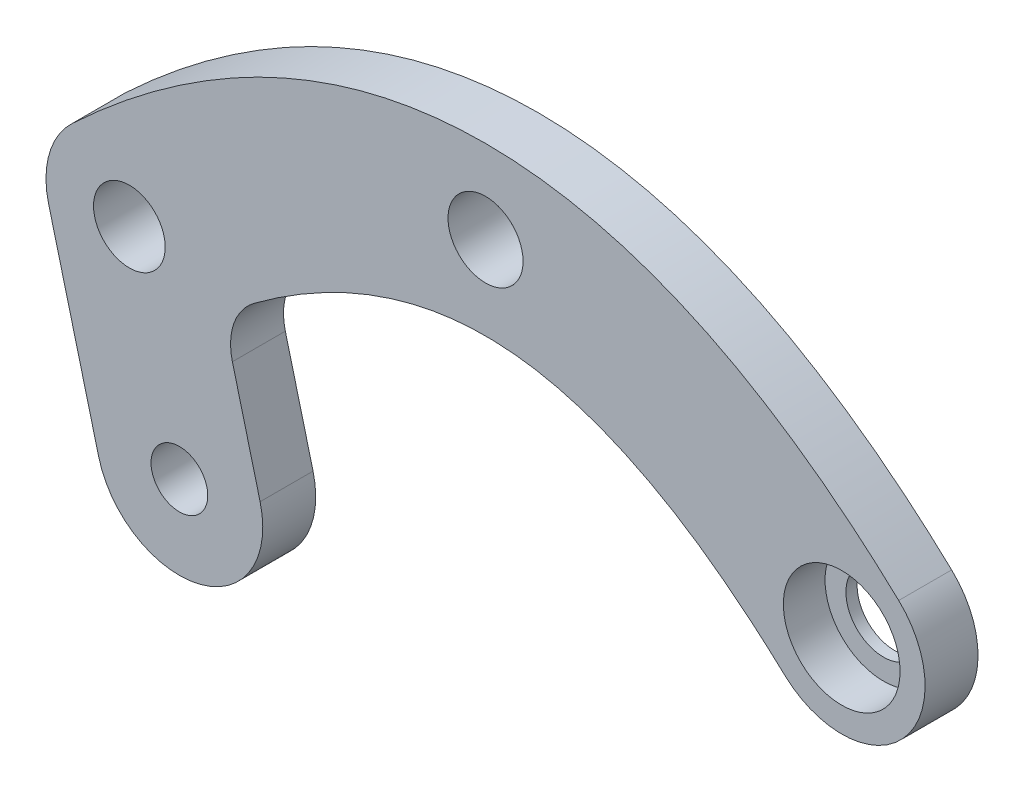
ISO-10303-21;
HEADER;
FILE_DESCRIPTION(('STEP AP214'),'2;1');
FILE_NAME('part.step','',(''),(''),'','','');
FILE_SCHEMA(('AUTOMOTIVE_DESIGN { 1 0 10303 214 1 1 1 1 }'));
ENDSEC;
DATA;
#1=APPLICATION_CONTEXT('core data for automotive mechanical design processes');
#2=APPLICATION_PROTOCOL_DEFINITION('international standard','automotive_design',2000,#1);
#3=PRODUCT_CONTEXT('',#1,'mechanical');
#4=PRODUCT('Part','Part','',(#3));
#5=PRODUCT_RELATED_PRODUCT_CATEGORY('part','',(#4));
#6=PRODUCT_DEFINITION_FORMATION('','',#4);
#7=PRODUCT_DEFINITION_CONTEXT('part definition',#1,'design');
#8=PRODUCT_DEFINITION('design','',#6,#7);
#9=PRODUCT_DEFINITION_SHAPE('','',#8);
#10=(LENGTH_UNIT() NAMED_UNIT(*) SI_UNIT(.MILLI.,.METRE.));
#11=(NAMED_UNIT(*) PLANE_ANGLE_UNIT() SI_UNIT($,.RADIAN.));
#12=(NAMED_UNIT(*) SI_UNIT($,.STERADIAN.) SOLID_ANGLE_UNIT());
#13=UNCERTAINTY_MEASURE_WITH_UNIT(LENGTH_MEASURE(1.E-05),#10,'distance_accuracy_value','');
#14=(GEOMETRIC_REPRESENTATION_CONTEXT(3) GLOBAL_UNCERTAINTY_ASSIGNED_CONTEXT((#13)) GLOBAL_UNIT_ASSIGNED_CONTEXT((#10,
#11,#12)) REPRESENTATION_CONTEXT('',''));
#15=CARTESIAN_POINT('',(0.,0.,0.));
#16=DIRECTION('',(0.,0.,1.));
#17=DIRECTION('',(1.,0.,0.));
#18=AXIS2_PLACEMENT_3D('',#15,#16,#17);
#19=CARTESIAN_POINT('',(21.36,-10.,1.5875));
#20=DIRECTION('',(0.,0.,1.));
#21=DIRECTION('',(1.,0.,0.));
#22=AXIS2_PLACEMENT_3D('',#19,#20,#21);
#23=CYLINDRICAL_SURFACE('',#22,2.24999999999999);
#24=CARTESIAN_POINT('',(21.36,-10.,-1.5875));
#25=DIRECTION('',(0.,0.,1.));
#26=DIRECTION('',(1.,0.,0.));
#27=AXIS2_PLACEMENT_3D('',#24,#25,#26);
#28=CIRCLE('',#27,2.25);
#29=CARTESIAN_POINT('',(23.61,-10.,-1.5875));
#30=VERTEX_POINT('',#29);
#31=EDGE_CURVE('E239',#30,#30,#28,.T.);
#32=ORIENTED_EDGE('',*,*,#31,.F.);
#33=EDGE_LOOP('',(#32));
#34=FACE_BOUND('',#33,.T.);
#35=CARTESIAN_POINT('',(21.36,-10.,-0.9125));
#36=DIRECTION('',(0.,0.,1.));
#37=DIRECTION('',(1.,0.,0.));
#38=AXIS2_PLACEMENT_3D('',#35,#36,#37);
#39=CIRCLE('',#38,2.24999999999999);
#40=CARTESIAN_POINT('',(23.61,-10.,-0.9125));
#41=VERTEX_POINT('',#40);
#42=EDGE_CURVE('E53',#41,#41,#39,.F.);
#43=ORIENTED_EDGE('',*,*,#42,.F.);
#44=EDGE_LOOP('',(#43));
#45=FACE_BOUND('',#44,.T.);
#46=ADVANCED_FACE('F49',(#34,#45),#23,.F.);
#47=CARTESIAN_POINT('',(0.,0.,-1.5875));
#48=DIRECTION('',(0.,0.,1.));
#49=DIRECTION('',(1.,0.,0.));
#50=AXIS2_PLACEMENT_3D('',#47,#48,#49);
#51=PLANE('',#50);
#52=CARTESIAN_POINT('',(0.,0.,-1.5875));
#53=DIRECTION('',(0.,0.,1.));
#54=DIRECTION('',(1.,0.,0.));
#55=AXIS2_PLACEMENT_3D('',#52,#53,#54);
#56=CIRCLE('',#55,2.25);
#57=CARTESIAN_POINT('',(2.25,0.,-1.5875));
#58=VERTEX_POINT('',#57);
#59=EDGE_CURVE('E252',#58,#58,#56,.T.);
#60=ORIENTED_EDGE('',*,*,#59,.T.);
#61=EDGE_LOOP('',(#60));
#62=FACE_BOUND('',#61,.T.);
#63=ORIENTED_EDGE('',*,*,#31,.T.);
#64=EDGE_LOOP('',(#63));
#65=FACE_BOUND('',#64,.T.);
#66=CARTESIAN_POINT('',(-17.9425685709007,-13.649816766278,-1.5875));
#67=CARTESIAN_POINT('',(-14.2685695152053,-10.2286843129854,-1.5875));
#68=CARTESIAN_POINT('',(-8.53005202111008,-6.88377787776774,-1.5875));
#69=CARTESIAN_POINT('',(-4.17884967888289,-5.36413027981006,-1.5875));
#70=CARTESIAN_POINT('',(0.,-4.87862324006331,-1.5875));
#71=CARTESIAN_POINT('',(4.17884967888289,-5.36413027981006,-1.5875));
#72=CARTESIAN_POINT('',(8.53005202111008,-6.88377787776774,-1.5875));
#73=CARTESIAN_POINT('',(14.2685695152053,-10.2286843129854,-1.5875));
#74=CARTESIAN_POINT('',(17.9425685709007,-13.649816766278,-1.5875));
#75=B_SPLINE_CURVE_WITH_KNOTS('',2,(#66,#67,#68,#69,#70,#71,#72,#73,#74),.UNSPECIFIED.,.F.,.F.,
(3,1,1,1,1,1,1,3),(0.,0.1875,0.3125,0.4375,0.5625,0.6875,0.8125,1.),.UNSPECIFIED.);
#76=CARTESIAN_POINT('',(-13.8750452365153,-10.2430725469191,-1.5875));
#77=VERTEX_POINT('',#76);
#78=CARTESIAN_POINT('',(17.9425685709007,-13.649816766278,-1.5875));
#79=VERTEX_POINT('',#78);
#80=EDGE_CURVE('E261',#77,#79,#75,.T.);
#81=ORIENTED_EDGE('',*,*,#80,.F.);
#82=CARTESIAN_POINT('',(-11.7922158615803,-13.0558686282069,-1.5875));
#83=DIRECTION('',(0.,0.,1.));
#84=DIRECTION('',(1.,0.,0.));
#85=AXIS2_PLACEMENT_3D('',#82,#83,#84);
#86=CIRCLE('',#85,3.5);
#87=CARTESIAN_POINT('',(-15.1810762895118,-13.9308686282069,-1.5875));
#88=VERTEX_POINT('',#87);
#89=EDGE_CURVE('E66',#77,#88,#86,.T.);
#90=ORIENTED_EDGE('',*,*,#89,.T.);
#91=DIRECTION('',(-0.25,0.968245836551854,0.));
#92=VECTOR('',#91,1.);
#93=CARTESIAN_POINT('',(-17.6043854086204,-4.5454327671869,-1.5875));
#94=LINE('',#93,#92);
#95=CARTESIAN_POINT('',(-13.5187708172407,-20.3689500386223,-1.5875));
#96=VERTEX_POINT('',#95);
#97=EDGE_CURVE('E228',#96,#88,#94,.T.);
#98=ORIENTED_EDGE('',*,*,#97,.F.);
#99=CARTESIAN_POINT('',(-18.36,-21.6189500386222,-1.5875));
#100=DIRECTION('',(0.,0.,-1.));
#101=DIRECTION('',(-1.,0.,0.));
#102=AXIS2_PLACEMENT_3D('',#99,#100,#101);
#103=CIRCLE('',#102,5.);
#104=CARTESIAN_POINT('',(-23.2012291827593,-22.8689500386223,-1.5875));
#105=VERTEX_POINT('',#104);
#106=EDGE_CURVE('E229',#105,#96,#103,.F.);
#107=ORIENTED_EDGE('',*,*,#106,.F.);
#108=DIRECTION('',(-0.25,0.968245836551854,0.));
#109=VECTOR('',#108,1.);
#110=CARTESIAN_POINT('',(-27.2868437741389,-7.0454327671869,-1.5875));
#111=LINE('',#110,#109);
#112=CARTESIAN_POINT('',(-26.2012291827593,-11.25,-1.5875));
#113=VERTEX_POINT('',#112);
#114=EDGE_CURVE('E224',#105,#113,#111,.T.);
#115=ORIENTED_EDGE('',*,*,#114,.T.);
#116=CARTESIAN_POINT('',(-21.36,-10.,-1.5875));
#117=DIRECTION('',(0.,0.,1.));
#118=DIRECTION('',(1.,0.,0.));
#119=AXIS2_PLACEMENT_3D('',#116,#117,#118);
#120=CIRCLE('',#119,5.);
#121=CARTESIAN_POINT('',(-24.7774314290993,-6.35018323372195,-1.5875));
#122=VERTEX_POINT('',#121);
#123=EDGE_CURVE('E136',#113,#122,#120,.F.);
#124=ORIENTED_EDGE('',*,*,#123,.T.);
#125=CARTESIAN_POINT('',(-24.7774314290993,-6.35018323372195,-1.5875));
#126=CARTESIAN_POINT('',(-20.4414304847947,-2.27131568701465,-1.5875));
#127=CARTESIAN_POINT('',(-12.8299479788899,2.19627787776774,-1.5875));
#128=CARTESIAN_POINT('',(-6.50115032111711,4.42663027981006,-1.5875));
#129=CARTESIAN_POINT('',(0.,5.19112324006331,-1.5875));
#130=CARTESIAN_POINT('',(6.50115032111711,4.42663027981006,-1.5875));
#131=CARTESIAN_POINT('',(12.8299479788899,2.19627787776774,-1.5875));
#132=CARTESIAN_POINT('',(20.4414304847947,-2.27131568701464,-1.5875));
#133=CARTESIAN_POINT('',(24.7774314290993,-6.35018323372195,-1.5875));
#134=B_SPLINE_CURVE_WITH_KNOTS('',2,(#125,#126,#127,#128,#129,#130,#131,#132,#133),
.UNSPECIFIED.,.F.,.F.,(3,1,1,1,1,1,1,3),(0.,0.1875,0.3125,0.4375,0.5625,0.6875,0.8125,1.),.UNSPECIFIED.);
#135=CARTESIAN_POINT('',(24.7774314290993,-6.35018323372195,-1.5875));
#136=VERTEX_POINT('',#135);
#137=EDGE_CURVE('E255',#122,#136,#134,.T.);
#138=ORIENTED_EDGE('',*,*,#137,.T.);
#139=CARTESIAN_POINT('',(21.36,-10.,-1.5875));
#140=DIRECTION('',(0.,0.,1.));
#141=DIRECTION('',(1.,0.,0.));
#142=AXIS2_PLACEMENT_3D('',#139,#140,#141);
#143=CIRCLE('',#142,5.);
#144=EDGE_CURVE('E151',#79,#136,#143,.T.);
#145=ORIENTED_EDGE('',*,*,#144,.F.);
#146=EDGE_LOOP('',(#81,#90,#98,#107,#115,#124,#138,#145));
#147=FACE_BOUND('',#146,.T.);
#148=CARTESIAN_POINT('',(-18.36,-21.6189500386222,-1.5875));
#149=DIRECTION('',(0.,0.,-1.));
#150=DIRECTION('',(-1.,0.,0.));
#151=AXIS2_PLACEMENT_3D('',#148,#149,#150);
#152=CIRCLE('',#151,1.69999999999999);
#153=CARTESIAN_POINT('',(-20.06,-21.6189500386222,-1.5875));
#154=VERTEX_POINT('',#153);
#155=EDGE_CURVE('E217',#154,#154,#152,.T.);
#156=ORIENTED_EDGE('',*,*,#155,.F.);
#157=EDGE_LOOP('',(#156));
#158=FACE_BOUND('',#157,.T.);
#159=CARTESIAN_POINT('',(-21.36,-10.,-1.5875));
#160=DIRECTION('',(0.,0.,1.));
#161=DIRECTION('',(1.,0.,0.));
#162=AXIS2_PLACEMENT_3D('',#159,#160,#161);
#163=CIRCLE('',#162,2.75);
#164=CARTESIAN_POINT('',(-18.61,-10.,-1.5875));
#165=VERTEX_POINT('',#164);
#166=EDGE_CURVE('E11',#165,#165,#163,.F.);
#167=ORIENTED_EDGE('',*,*,#166,.F.);
#168=EDGE_LOOP('',(#167));
#169=FACE_BOUND('',#168,.T.);
#170=ADVANCED_FACE('F175',(#62,#65,#147,#158,#169),#51,.F.);
#171=CARTESIAN_POINT('',(-21.36,-10.,1.5875));
#172=DIRECTION('',(0.,0.,-1.));
#173=DIRECTION('',(-1.,0.,0.));
#174=AXIS2_PLACEMENT_3D('',#171,#172,#173);
#175=CYLINDRICAL_SURFACE('',#174,5.);
#176=ORIENTED_EDGE('',*,*,#123,.F.);
#177=DIRECTION('',(0.,0.,-1.));
#178=VECTOR('',#177,1.);
#179=CARTESIAN_POINT('',(-26.2012291827593,-11.25,21.6150258635163));
#180=LINE('',#179,#178);
#181=CARTESIAN_POINT('',(-26.2012291827593,-11.25,1.5875));
#182=VERTEX_POINT('',#181);
#183=EDGE_CURVE('E122',#182,#113,#180,.T.);
#184=ORIENTED_EDGE('',*,*,#183,.F.);
#185=CARTESIAN_POINT('',(-21.36,-10.,1.5875));
#186=DIRECTION('',(0.,0.,1.));
#187=DIRECTION('',(1.,0.,0.));
#188=AXIS2_PLACEMENT_3D('',#185,#186,#187);
#189=CIRCLE('',#188,5.);
#190=CARTESIAN_POINT('',(-24.7774314290993,-6.35018323372195,1.5875));
#191=VERTEX_POINT('',#190);
#192=EDGE_CURVE('E134',#182,#191,#189,.F.);
#193=ORIENTED_EDGE('',*,*,#192,.T.);
#194=DIRECTION('',(0.,0.,-1.));
#195=VECTOR('',#194,1.);
#196=CARTESIAN_POINT('',(-24.7774314290993,-6.35018323372195,1.5875));
#197=LINE('',#196,#195);
#198=EDGE_CURVE('E286',#191,#122,#197,.T.);
#199=ORIENTED_EDGE('',*,*,#198,.T.);
#200=EDGE_LOOP('',(#176,#184,#193,#199));
#201=FACE_BOUND('',#200,.T.);
#202=ADVANCED_FACE('F132',(#201),#175,.T.);
#203=CARTESIAN_POINT('',(-17.9425685709007,-13.649816766278,1.5875));
#204=CARTESIAN_POINT('',(-14.2685695152053,-10.2286843129854,1.5875));
#205=CARTESIAN_POINT('',(-8.53005202111008,-6.88377787776774,1.5875));
#206=CARTESIAN_POINT('',(-4.17884967888289,-5.36413027981006,1.5875));
#207=CARTESIAN_POINT('',(0.,-4.87862324006331,1.5875));
#208=CARTESIAN_POINT('',(4.17884967888289,-5.36413027981006,1.5875));
#209=CARTESIAN_POINT('',(8.53005202111008,-6.88377787776774,1.5875));
#210=CARTESIAN_POINT('',(14.2685695152053,-10.2286843129854,1.5875));
#211=CARTESIAN_POINT('',(17.9425685709007,-13.649816766278,1.5875));
#212=B_SPLINE_CURVE_WITH_KNOTS('',2,(#203,#204,#205,#206,#207,#208,#209,#210,#211),
.UNSPECIFIED.,.F.,.F.,(3,1,1,1,1,1,1,3),(0.,0.1875,0.3125,0.4375,0.5625,0.6875,0.8125,1.),.UNSPECIFIED.);
#213=DIRECTION('',(0.,0.,-1.));
#214=VECTOR('',#213,1.);
#215=SURFACE_OF_LINEAR_EXTRUSION('',#212,#214);
#216=CARTESIAN_POINT('',(-13.8750452365153,-10.2430725469191,1.5875));
#217=VERTEX_POINT('',#216);
#218=CARTESIAN_POINT('',(17.9425685709007,-13.649816766278,1.5875));
#219=VERTEX_POINT('',#218);
#220=EDGE_CURVE('E145',#217,#219,#212,.T.);
#221=ORIENTED_EDGE('',*,*,#220,.F.);
#222=DIRECTION('',(0.,0.,-1.));
#223=VECTOR('',#222,1.);
#224=CARTESIAN_POINT('',(-13.8750452365153,-10.2430725469191,1.5875));
#225=LINE('',#224,#223);
#226=EDGE_CURVE('E289',#217,#77,#225,.T.);
#227=ORIENTED_EDGE('',*,*,#226,.T.);
#228=ORIENTED_EDGE('',*,*,#80,.T.);
#229=DIRECTION('',(0.,0.,-1.));
#230=VECTOR('',#229,1.);
#231=CARTESIAN_POINT('',(17.9425685709007,-13.649816766278,1.5875));
#232=LINE('',#231,#230);
#233=EDGE_CURVE('E282',#219,#79,#232,.T.);
#234=ORIENTED_EDGE('',*,*,#233,.F.);
#235=EDGE_LOOP('',(#221,#227,#228,#234));
#236=FACE_BOUND('',#235,.T.);
#237=ADVANCED_FACE('F166',(#236),#215,.F.);
#238=CARTESIAN_POINT('',(-24.7774314290993,-6.35018323372195,1.5875));
#239=CARTESIAN_POINT('',(-20.4414304847947,-2.27131568701465,1.5875));
#240=CARTESIAN_POINT('',(-12.8299479788899,2.19627787776774,1.5875));
#241=CARTESIAN_POINT('',(-6.50115032111711,4.42663027981006,1.5875));
#242=CARTESIAN_POINT('',(0.,5.19112324006331,1.5875));
#243=CARTESIAN_POINT('',(6.50115032111711,4.42663027981006,1.5875));
#244=CARTESIAN_POINT('',(12.8299479788899,2.19627787776774,1.5875));
#245=CARTESIAN_POINT('',(20.4414304847947,-2.27131568701464,1.5875));
#246=CARTESIAN_POINT('',(24.7774314290993,-6.35018323372195,1.5875));
#247=B_SPLINE_CURVE_WITH_KNOTS('',2,(#238,#239,#240,#241,#242,#243,#244,#245,#246),
.UNSPECIFIED.,.F.,.F.,(3,1,1,1,1,1,1,3),(0.,0.1875,0.3125,0.4375,0.5625,0.6875,0.8125,1.),.UNSPECIFIED.);
#248=DIRECTION('',(0.,0.,-1.));
#249=VECTOR('',#248,1.);
#250=SURFACE_OF_LINEAR_EXTRUSION('',#247,#249);
#251=ORIENTED_EDGE('',*,*,#137,.F.);
#252=ORIENTED_EDGE('',*,*,#198,.F.);
#253=CARTESIAN_POINT('',(24.7774314290993,-6.35018323372195,1.5875));
#254=VERTEX_POINT('',#253);
#255=EDGE_CURVE('E143',#191,#254,#247,.T.);
#256=ORIENTED_EDGE('',*,*,#255,.T.);
#257=DIRECTION('',(0.,0.,-1.));
#258=VECTOR('',#257,1.);
#259=CARTESIAN_POINT('',(24.7774314290993,-6.35018323372195,1.5875));
#260=LINE('',#259,#258);
#261=EDGE_CURVE('E279',#254,#136,#260,.T.);
#262=ORIENTED_EDGE('',*,*,#261,.T.);
#263=EDGE_LOOP('',(#251,#252,#256,#262));
#264=FACE_BOUND('',#263,.T.);
#265=ADVANCED_FACE('F170',(#264),#250,.T.);
#266=CARTESIAN_POINT('',(21.36,-10.,1.5875));
#267=DIRECTION('',(0.,0.,-1.));
#268=DIRECTION('',(-1.,0.,0.));
#269=AXIS2_PLACEMENT_3D('',#266,#267,#268);
#270=CYLINDRICAL_SURFACE('',#269,5.);
#271=ORIENTED_EDGE('',*,*,#144,.T.);
#272=ORIENTED_EDGE('',*,*,#261,.F.);
#273=CARTESIAN_POINT('',(21.36,-10.,1.5875));
#274=DIRECTION('',(0.,0.,1.));
#275=DIRECTION('',(1.,0.,0.));
#276=AXIS2_PLACEMENT_3D('',#273,#274,#275);
#277=CIRCLE('',#276,5.);
#278=EDGE_CURVE('E149',#219,#254,#277,.T.);
#279=ORIENTED_EDGE('',*,*,#278,.F.);
#280=ORIENTED_EDGE('',*,*,#233,.T.);
#281=EDGE_LOOP('',(#271,#272,#279,#280));
#282=FACE_BOUND('',#281,.T.);
#283=ADVANCED_FACE('F172',(#282),#270,.T.);
#284=CARTESIAN_POINT('',(0.,0.,1.5875));
#285=DIRECTION('',(0.,0.,1.));
#286=DIRECTION('',(1.,0.,0.));
#287=AXIS2_PLACEMENT_3D('',#284,#285,#286);
#288=PLANE('',#287);
#289=CARTESIAN_POINT('',(21.36,-10.,1.5875));
#290=DIRECTION('',(0.,0.,1.));
#291=DIRECTION('',(1.,0.,0.));
#292=AXIS2_PLACEMENT_3D('',#289,#290,#291);
#293=CIRCLE('',#292,3.5);
#294=CARTESIAN_POINT('',(24.86,-10.,1.5875));
#295=VERTEX_POINT('',#294);
#296=EDGE_CURVE('E208',#295,#295,#293,.T.);
#297=ORIENTED_EDGE('',*,*,#296,.F.);
#298=EDGE_LOOP('',(#297));
#299=FACE_BOUND('',#298,.T.);
#300=CARTESIAN_POINT('',(-21.36,-10.,1.5875));
#301=DIRECTION('',(0.,0.,-1.));
#302=DIRECTION('',(-1.,0.,0.));
#303=AXIS2_PLACEMENT_3D('',#300,#301,#302);
#304=CIRCLE('',#303,2.15);
#305=CARTESIAN_POINT('',(-23.51,-10.,1.5875));
#306=VERTEX_POINT('',#305);
#307=EDGE_CURVE('E212',#306,#306,#304,.T.);
#308=ORIENTED_EDGE('',*,*,#307,.T.);
#309=EDGE_LOOP('',(#308));
#310=FACE_BOUND('',#309,.T.);
#311=CARTESIAN_POINT('',(-18.36,-21.6189500386222,1.5875));
#312=DIRECTION('',(0.,0.,-1.));
#313=DIRECTION('',(-1.,0.,0.));
#314=AXIS2_PLACEMENT_3D('',#311,#312,#313);
#315=CIRCLE('',#314,1.7);
#316=CARTESIAN_POINT('',(-20.06,-21.6189500386222,1.5875));
#317=VERTEX_POINT('',#316);
#318=EDGE_CURVE('E129',#317,#317,#315,.T.);
#319=ORIENTED_EDGE('',*,*,#318,.T.);
#320=EDGE_LOOP('',(#319));
#321=FACE_BOUND('',#320,.T.);
#322=DIRECTION('',(-0.25,0.968245836551854,0.));
#323=VECTOR('',#322,1.);
#324=CARTESIAN_POINT('',(-17.6043854086204,-4.5454327671869,1.5875));
#325=LINE('',#324,#323);
#326=CARTESIAN_POINT('',(-13.5187708172407,-20.3689500386223,1.5875));
#327=VERTEX_POINT('',#326);
#328=CARTESIAN_POINT('',(-15.1810762895118,-13.9308686282069,1.5875));
#329=VERTEX_POINT('',#328);
#330=EDGE_CURVE('E236',#327,#329,#325,.T.);
#331=ORIENTED_EDGE('',*,*,#330,.T.);
#332=CARTESIAN_POINT('',(-11.7922158615803,-13.0558686282069,1.5875));
#333=DIRECTION('',(0.,0.,1.));
#334=DIRECTION('',(1.,0.,0.));
#335=AXIS2_PLACEMENT_3D('',#332,#333,#334);
#336=CIRCLE('',#335,3.5);
#337=EDGE_CURVE('E59',#329,#217,#336,.F.);
#338=ORIENTED_EDGE('',*,*,#337,.T.);
#339=ORIENTED_EDGE('',*,*,#220,.T.);
#340=ORIENTED_EDGE('',*,*,#278,.T.);
#341=ORIENTED_EDGE('',*,*,#255,.F.);
#342=ORIENTED_EDGE('',*,*,#192,.F.);
#343=DIRECTION('',(-0.25,0.968245836551854,0.));
#344=VECTOR('',#343,1.);
#345=CARTESIAN_POINT('',(-27.2868437741389,-7.0454327671869,1.5875));
#346=LINE('',#345,#344);
#347=CARTESIAN_POINT('',(-23.2012291827593,-22.8689500386223,1.5875));
#348=VERTEX_POINT('',#347);
#349=EDGE_CURVE('E118',#348,#182,#346,.T.);
#350=ORIENTED_EDGE('',*,*,#349,.F.);
#351=CARTESIAN_POINT('',(-18.36,-21.6189500386222,1.5875));
#352=DIRECTION('',(0.,0.,1.));
#353=DIRECTION('',(1.,0.,0.));
#354=AXIS2_PLACEMENT_3D('',#351,#352,#353);
#355=CIRCLE('',#354,5.);
#356=EDGE_CURVE('E227',#348,#327,#355,.T.);
#357=ORIENTED_EDGE('',*,*,#356,.T.);
#358=EDGE_LOOP('',(#331,#338,#339,#340,#341,#342,#350,#357));
#359=FACE_BOUND('',#358,.T.);
#360=CARTESIAN_POINT('',(0.,0.,1.5875));
#361=DIRECTION('',(0.,0.,1.));
#362=DIRECTION('',(1.,0.,0.));
#363=AXIS2_PLACEMENT_3D('',#360,#361,#362);
#364=CIRCLE('',#363,2.24999999999999);
#365=CARTESIAN_POINT('',(2.24999999999999,0.,1.5875));
#366=VERTEX_POINT('',#365);
#367=EDGE_CURVE('E249',#366,#366,#364,.T.);
#368=ORIENTED_EDGE('',*,*,#367,.F.);
#369=EDGE_LOOP('',(#368));
#370=FACE_BOUND('',#369,.T.);
#371=ADVANCED_FACE('F140',(#299,#310,#321,#359,#370),#288,.T.);
#372=CARTESIAN_POINT('',(0.,0.,1.5875));
#373=DIRECTION('',(0.,0.,1.));
#374=DIRECTION('',(1.,0.,0.));
#375=AXIS2_PLACEMENT_3D('',#372,#373,#374);
#376=CYLINDRICAL_SURFACE('',#375,2.24999999999999);
#377=ORIENTED_EDGE('',*,*,#59,.F.);
#378=EDGE_LOOP('',(#377));
#379=FACE_BOUND('',#378,.T.);
#380=ORIENTED_EDGE('',*,*,#367,.T.);
#381=EDGE_LOOP('',(#380));
#382=FACE_BOUND('',#381,.T.);
#383=ADVANCED_FACE('F197',(#379,#382),#376,.F.);
#384=CARTESIAN_POINT('',(-27.2868437741389,-7.0454327671869,21.6150258635163));
#385=DIRECTION('',(-0.968245836551854,-0.25,0.));
#386=DIRECTION('',(0.25,-0.968245836551854,0.));
#387=AXIS2_PLACEMENT_3D('',#384,#385,#386);
#388=PLANE('',#387);
#389=DIRECTION('',(0.,0.,-1.));
#390=VECTOR('',#389,1.);
#391=CARTESIAN_POINT('',(-23.2012291827593,-22.8689500386223,21.6150258635163));
#392=LINE('',#391,#390);
#393=EDGE_CURVE('E124',#348,#105,#392,.T.);
#394=ORIENTED_EDGE('',*,*,#393,.F.);
#395=ORIENTED_EDGE('',*,*,#349,.T.);
#396=ORIENTED_EDGE('',*,*,#183,.T.);
#397=ORIENTED_EDGE('',*,*,#114,.F.);
#398=EDGE_LOOP('',(#394,#395,#396,#397));
#399=FACE_BOUND('',#398,.T.);
#400=ADVANCED_FACE('F120',(#399),#388,.T.);
#401=CARTESIAN_POINT('',(-18.36,-21.6189500386222,21.6150258635163));
#402=DIRECTION('',(0.,0.,-1.));
#403=DIRECTION('',(-1.,0.,0.));
#404=AXIS2_PLACEMENT_3D('',#401,#402,#403);
#405=CYLINDRICAL_SURFACE('',#404,5.);
#406=ORIENTED_EDGE('',*,*,#356,.F.);
#407=ORIENTED_EDGE('',*,*,#393,.T.);
#408=ORIENTED_EDGE('',*,*,#106,.T.);
#409=DIRECTION('',(0.,0.,-1.));
#410=VECTOR('',#409,1.);
#411=CARTESIAN_POINT('',(-13.5187708172407,-20.3689500386223,21.6150258635163));
#412=LINE('',#411,#410);
#413=EDGE_CURVE('E233',#327,#96,#412,.T.);
#414=ORIENTED_EDGE('',*,*,#413,.F.);
#415=EDGE_LOOP('',(#406,#407,#408,#414));
#416=FACE_BOUND('',#415,.T.);
#417=ADVANCED_FACE('F313',(#416),#405,.T.);
#418=CARTESIAN_POINT('',(-17.6043854086204,-4.5454327671869,21.6150258635163));
#419=DIRECTION('',(-0.968245836551854,-0.25,0.));
#420=DIRECTION('',(0.25,-0.968245836551854,0.));
#421=AXIS2_PLACEMENT_3D('',#418,#419,#420);
#422=PLANE('',#421);
#423=ORIENTED_EDGE('',*,*,#97,.T.);
#424=DIRECTION('',(0.,0.,1.));
#425=VECTOR('',#424,1.);
#426=CARTESIAN_POINT('',(-15.1810762895118,-13.9308686282069,1.5875));
#427=LINE('',#426,#425);
#428=EDGE_CURVE('E73',#88,#329,#427,.T.);
#429=ORIENTED_EDGE('',*,*,#428,.T.);
#430=ORIENTED_EDGE('',*,*,#330,.F.);
#431=ORIENTED_EDGE('',*,*,#413,.T.);
#432=EDGE_LOOP('',(#423,#429,#430,#431));
#433=FACE_BOUND('',#432,.T.);
#434=ADVANCED_FACE('F306',(#433),#422,.F.);
#435=CARTESIAN_POINT('',(-11.7922158615803,-13.0558686282069,0.));
#436=DIRECTION('',(0.,0.,-1.));
#437=DIRECTION('',(-1.,0.,0.));
#438=AXIS2_PLACEMENT_3D('',#435,#436,#437);
#439=CYLINDRICAL_SURFACE('',#438,3.5);
#440=ORIENTED_EDGE('',*,*,#337,.F.);
#441=ORIENTED_EDGE('',*,*,#428,.F.);
#442=ORIENTED_EDGE('',*,*,#89,.F.);
#443=ORIENTED_EDGE('',*,*,#226,.F.);
#444=EDGE_LOOP('',(#440,#441,#442,#443));
#445=FACE_BOUND('',#444,.T.);
#446=ADVANCED_FACE('F51',(#445),#439,.F.);
#447=CARTESIAN_POINT('',(-18.36,-21.6189500386222,-1.5875));
#448=DIRECTION('',(0.,0.,-1.));
#449=DIRECTION('',(-1.,0.,0.));
#450=AXIS2_PLACEMENT_3D('',#447,#448,#449);
#451=CYLINDRICAL_SURFACE('',#450,1.69999999999999);
#452=ORIENTED_EDGE('',*,*,#318,.F.);
#453=EDGE_LOOP('',(#452));
#454=FACE_BOUND('',#453,.T.);
#455=ORIENTED_EDGE('',*,*,#155,.T.);
#456=EDGE_LOOP('',(#455));
#457=FACE_BOUND('',#456,.T.);
#458=ADVANCED_FACE('F305',(#454,#457),#451,.F.);
#459=CARTESIAN_POINT('',(-21.36,-10.,1.5875));
#460=DIRECTION('',(0.,0.,-1.));
#461=DIRECTION('',(-1.,0.,0.));
#462=AXIS2_PLACEMENT_3D('',#459,#460,#461);
#463=CYLINDRICAL_SURFACE('',#462,2.15);
#464=ORIENTED_EDGE('',*,*,#307,.F.);
#465=EDGE_LOOP('',(#464));
#466=FACE_BOUND('',#465,.T.);
#467=CARTESIAN_POINT('',(-21.36,-10.,-2.3375));
#468=DIRECTION('',(0.,0.,-1.));
#469=DIRECTION('',(-1.,0.,0.));
#470=AXIS2_PLACEMENT_3D('',#467,#468,#469);
#471=CIRCLE('',#470,2.15);
#472=CARTESIAN_POINT('',(-23.51,-10.,-2.3375));
#473=VERTEX_POINT('',#472);
#474=EDGE_CURVE('E345',#473,#473,#471,.T.);
#475=ORIENTED_EDGE('',*,*,#474,.T.);
#476=EDGE_LOOP('',(#475));
#477=FACE_BOUND('',#476,.T.);
#478=ADVANCED_FACE('F311',(#466,#477),#463,.F.);
#479=CARTESIAN_POINT('',(-21.36,-10.,-2.3375));
#480=DIRECTION('',(0.,0.,-1.));
#481=DIRECTION('',(-1.,0.,0.));
#482=AXIS2_PLACEMENT_3D('',#479,#480,#481);
#483=PLANE('',#482);
#484=CARTESIAN_POINT('',(-21.36,-10.,-2.3375));
#485=DIRECTION('',(0.,0.,-1.));
#486=DIRECTION('',(-1.,0.,0.));
#487=AXIS2_PLACEMENT_3D('',#484,#485,#486);
#488=CIRCLE('',#487,2.75);
#489=CARTESIAN_POINT('',(-24.11,-10.,-2.3375));
#490=VERTEX_POINT('',#489);
#491=EDGE_CURVE('E349',#490,#490,#488,.T.);
#492=ORIENTED_EDGE('',*,*,#491,.T.);
#493=EDGE_LOOP('',(#492));
#494=FACE_BOUND('',#493,.T.);
#495=ORIENTED_EDGE('',*,*,#474,.F.);
#496=EDGE_LOOP('',(#495));
#497=FACE_BOUND('',#496,.T.);
#498=ADVANCED_FACE('F322',(#494,#497),#483,.T.);
#499=CARTESIAN_POINT('',(-21.36,-10.,-2.3375));
#500=DIRECTION('',(0.,0.,1.));
#501=DIRECTION('',(1.,0.,0.));
#502=AXIS2_PLACEMENT_3D('',#499,#500,#501);
#503=CYLINDRICAL_SURFACE('',#502,2.75);
#504=ORIENTED_EDGE('',*,*,#491,.F.);
#505=EDGE_LOOP('',(#504));
#506=FACE_BOUND('',#505,.T.);
#507=ORIENTED_EDGE('',*,*,#166,.T.);
#508=EDGE_LOOP('',(#507));
#509=FACE_BOUND('',#508,.T.);
#510=ADVANCED_FACE('F324',(#506,#509),#503,.T.);
#511=CARTESIAN_POINT('',(21.36,-10.,-0.9125));
#512=DIRECTION('',(0.,0.,1.));
#513=DIRECTION('',(1.,0.,0.));
#514=AXIS2_PLACEMENT_3D('',#511,#512,#513);
#515=PLANE('',#514);
#516=CARTESIAN_POINT('',(21.36,-10.,-0.9125));
#517=DIRECTION('',(0.,0.,1.));
#518=DIRECTION('',(1.,0.,0.));
#519=AXIS2_PLACEMENT_3D('',#516,#517,#518);
#520=CIRCLE('',#519,3.5);
#521=CARTESIAN_POINT('',(24.86,-10.,-0.9125));
#522=VERTEX_POINT('',#521);
#523=EDGE_CURVE('E341',#522,#522,#520,.T.);
#524=ORIENTED_EDGE('',*,*,#523,.T.);
#525=EDGE_LOOP('',(#524));
#526=FACE_BOUND('',#525,.T.);
#527=ORIENTED_EDGE('',*,*,#42,.T.);
#528=EDGE_LOOP('',(#527));
#529=FACE_BOUND('',#528,.T.);
#530=ADVANCED_FACE('F326',(#526,#529),#515,.T.);
#531=CARTESIAN_POINT('',(21.36,-10.,-0.9125));
#532=DIRECTION('',(0.,0.,1.));
#533=DIRECTION('',(1.,0.,0.));
#534=AXIS2_PLACEMENT_3D('',#531,#532,#533);
#535=CYLINDRICAL_SURFACE('',#534,3.5);
#536=ORIENTED_EDGE('',*,*,#523,.F.);
#537=EDGE_LOOP('',(#536));
#538=FACE_BOUND('',#537,.T.);
#539=ORIENTED_EDGE('',*,*,#296,.T.);
#540=EDGE_LOOP('',(#539));
#541=FACE_BOUND('',#540,.T.);
#542=ADVANCED_FACE('F331',(#538,#541),#535,.F.);
#543=CLOSED_SHELL('',(#46,#170,#202,#237,#265,#283,#371,#383,#400,#417,#434,#446,#458,#478,#498,
#510,#530,#542));
#544=MANIFOLD_SOLID_BREP('B2',#543);
#545=ADVANCED_BREP_SHAPE_REPRESENTATION('',(#18,#544),#14);
#546=SHAPE_DEFINITION_REPRESENTATION(#9,#545);
ENDSEC;
END-ISO-10303-21;
